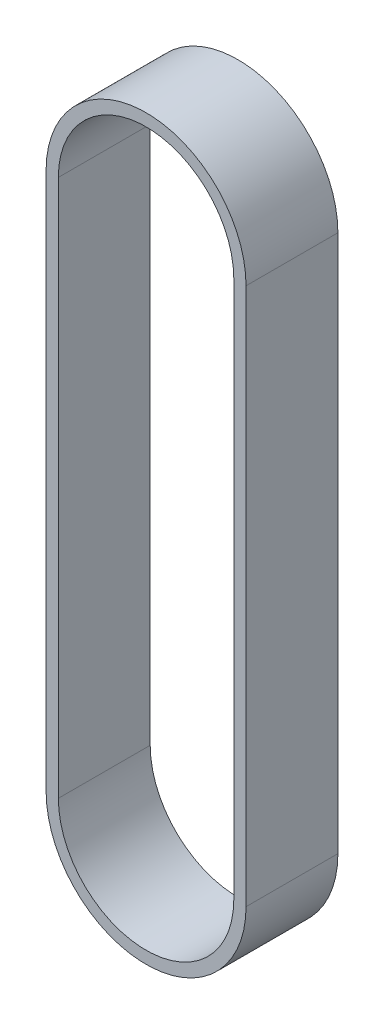
ISO-10303-21;
HEADER;
FILE_DESCRIPTION(('STEP AP214'),'2;1');
FILE_NAME('part.step','',(''),(''),'','','');
FILE_SCHEMA(('AUTOMOTIVE_DESIGN { 1 0 10303 214 1 1 1 1 }'));
ENDSEC;
DATA;
#1=APPLICATION_CONTEXT('core data for automotive mechanical design processes');
#2=APPLICATION_PROTOCOL_DEFINITION('international standard','automotive_design',2000,#1);
#3=PRODUCT_CONTEXT('',#1,'mechanical');
#4=PRODUCT('Part','Part','',(#3));
#5=PRODUCT_RELATED_PRODUCT_CATEGORY('part','',(#4));
#6=PRODUCT_DEFINITION_FORMATION('','',#4);
#7=PRODUCT_DEFINITION_CONTEXT('part definition',#1,'design');
#8=PRODUCT_DEFINITION('design','',#6,#7);
#9=PRODUCT_DEFINITION_SHAPE('','',#8);
#10=(LENGTH_UNIT() NAMED_UNIT(*) SI_UNIT(.MILLI.,.METRE.));
#11=(NAMED_UNIT(*) PLANE_ANGLE_UNIT() SI_UNIT($,.RADIAN.));
#12=(NAMED_UNIT(*) SI_UNIT($,.STERADIAN.) SOLID_ANGLE_UNIT());
#13=UNCERTAINTY_MEASURE_WITH_UNIT(LENGTH_MEASURE(1.E-05),#10,'distance_accuracy_value','');
#14=(GEOMETRIC_REPRESENTATION_CONTEXT(3) GLOBAL_UNCERTAINTY_ASSIGNED_CONTEXT((#13)) GLOBAL_UNIT_ASSIGNED_CONTEXT((#10,
#11,#12)) REPRESENTATION_CONTEXT('',''));
#15=CARTESIAN_POINT('',(0.,0.,0.));
#16=DIRECTION('',(0.,0.,1.));
#17=DIRECTION('',(1.,0.,0.));
#18=AXIS2_PLACEMENT_3D('',#15,#16,#17);
#19=CARTESIAN_POINT('',(0.,0.,7.5));
#20=DIRECTION('',(0.,0.,1.));
#21=DIRECTION('',(1.,0.,0.));
#22=AXIS2_PLACEMENT_3D('',#19,#20,#21);
#23=PLANE('',#22);
#24=CARTESIAN_POINT('',(0.,0.,7.5));
#25=DIRECTION('',(0.,0.,1.));
#26=DIRECTION('',(1.,0.,0.));
#27=AXIS2_PLACEMENT_3D('',#24,#25,#26);
#28=CIRCLE('',#27,16.325);
#29=CARTESIAN_POINT('',(16.325,0.,7.5));
#30=VERTEX_POINT('',#29);
#31=CARTESIAN_POINT('',(-16.325,0.,7.5));
#32=VERTEX_POINT('',#31);
#33=EDGE_CURVE('E159',#30,#32,#28,.T.);
#34=ORIENTED_EDGE('',*,*,#33,.T.);
#35=DIRECTION('',(0.,-1.,0.));
#36=VECTOR('',#35,1.);
#37=CARTESIAN_POINT('',(-16.325,0.,7.5));
#38=LINE('',#37,#36);
#39=CARTESIAN_POINT('',(-16.325,-87.8,7.5));
#40=VERTEX_POINT('',#39);
#41=EDGE_CURVE('E162',#32,#40,#38,.T.);
#42=ORIENTED_EDGE('',*,*,#41,.T.);
#43=CARTESIAN_POINT('',(0.,-87.8,7.5));
#44=DIRECTION('',(0.,0.,1.));
#45=DIRECTION('',(1.,0.,0.));
#46=AXIS2_PLACEMENT_3D('',#43,#44,#45);
#47=CIRCLE('',#46,16.325);
#48=CARTESIAN_POINT('',(16.325,-87.8,7.5));
#49=VERTEX_POINT('',#48);
#50=EDGE_CURVE('E165',#40,#49,#47,.T.);
#51=ORIENTED_EDGE('',*,*,#50,.T.);
#52=DIRECTION('',(0.,1.,0.));
#53=VECTOR('',#52,1.);
#54=CARTESIAN_POINT('',(16.325,0.,7.5));
#55=LINE('',#54,#53);
#56=EDGE_CURVE('E167',#49,#30,#55,.T.);
#57=ORIENTED_EDGE('',*,*,#56,.T.);
#58=EDGE_LOOP('',(#34,#42,#51,#57));
#59=FACE_BOUND('',#58,.T.);
#60=DIRECTION('',(0.,-1.,0.));
#61=VECTOR('',#60,1.);
#62=CARTESIAN_POINT('',(-14.325,0.,7.5));
#63=LINE('',#62,#61);
#64=CARTESIAN_POINT('',(-14.325,0.,7.5));
#65=VERTEX_POINT('',#64);
#66=CARTESIAN_POINT('',(-14.325,-87.8,7.5));
#67=VERTEX_POINT('',#66);
#68=EDGE_CURVE('E131',#65,#67,#63,.T.);
#69=ORIENTED_EDGE('',*,*,#68,.F.);
#70=CARTESIAN_POINT('',(0.,0.,7.5));
#71=DIRECTION('',(0.,0.,1.));
#72=DIRECTION('',(1.,0.,0.));
#73=AXIS2_PLACEMENT_3D('',#70,#71,#72);
#74=CIRCLE('',#73,14.325);
#75=CARTESIAN_POINT('',(14.325,0.,7.5));
#76=VERTEX_POINT('',#75);
#77=EDGE_CURVE('E123',#76,#65,#74,.T.);
#78=ORIENTED_EDGE('',*,*,#77,.F.);
#79=DIRECTION('',(0.,1.,0.));
#80=VECTOR('',#79,1.);
#81=CARTESIAN_POINT('',(14.325,0.,7.5));
#82=LINE('',#81,#80);
#83=CARTESIAN_POINT('',(14.325,-87.8,7.5));
#84=VERTEX_POINT('',#83);
#85=EDGE_CURVE('E145',#84,#76,#82,.T.);
#86=ORIENTED_EDGE('',*,*,#85,.F.);
#87=CARTESIAN_POINT('',(0.,-87.8,7.5));
#88=DIRECTION('',(0.,0.,1.));
#89=DIRECTION('',(1.,0.,0.));
#90=AXIS2_PLACEMENT_3D('',#87,#88,#89);
#91=CIRCLE('',#90,14.325);
#92=EDGE_CURVE('E143',#67,#84,#91,.T.);
#93=ORIENTED_EDGE('',*,*,#92,.F.);
#94=EDGE_LOOP('',(#69,#78,#86,#93));
#95=FACE_BOUND('',#94,.T.);
#96=ADVANCED_FACE('F58',(#59,#95),#23,.T.);
#97=CARTESIAN_POINT('',(0.,0.,-7.5));
#98=DIRECTION('',(0.,0.,1.));
#99=DIRECTION('',(1.,0.,0.));
#100=AXIS2_PLACEMENT_3D('',#97,#98,#99);
#101=PLANE('',#100);
#102=CARTESIAN_POINT('',(0.,0.,-7.5));
#103=DIRECTION('',(0.,0.,1.));
#104=DIRECTION('',(1.,0.,0.));
#105=AXIS2_PLACEMENT_3D('',#102,#103,#104);
#106=CIRCLE('',#105,16.325);
#107=CARTESIAN_POINT('',(16.325,0.,-7.5));
#108=VERTEX_POINT('',#107);
#109=CARTESIAN_POINT('',(-16.325,0.,-7.5));
#110=VERTEX_POINT('',#109);
#111=EDGE_CURVE('E139',#108,#110,#106,.T.);
#112=ORIENTED_EDGE('',*,*,#111,.F.);
#113=DIRECTION('',(0.,1.,0.));
#114=VECTOR('',#113,1.);
#115=CARTESIAN_POINT('',(16.325,0.,-7.5));
#116=LINE('',#115,#114);
#117=CARTESIAN_POINT('',(16.325,-87.8,-7.5));
#118=VERTEX_POINT('',#117);
#119=EDGE_CURVE('E163',#118,#108,#116,.T.);
#120=ORIENTED_EDGE('',*,*,#119,.F.);
#121=CARTESIAN_POINT('',(0.,-87.8,-7.5));
#122=DIRECTION('',(0.,0.,1.));
#123=DIRECTION('',(1.,0.,0.));
#124=AXIS2_PLACEMENT_3D('',#121,#122,#123);
#125=CIRCLE('',#124,16.325);
#126=CARTESIAN_POINT('',(-16.325,-87.8,-7.5));
#127=VERTEX_POINT('',#126);
#128=EDGE_CURVE('E174',#127,#118,#125,.T.);
#129=ORIENTED_EDGE('',*,*,#128,.F.);
#130=DIRECTION('',(0.,-1.,0.));
#131=VECTOR('',#130,1.);
#132=CARTESIAN_POINT('',(-16.325,0.,-7.5));
#133=LINE('',#132,#131);
#134=EDGE_CURVE('E172',#110,#127,#133,.T.);
#135=ORIENTED_EDGE('',*,*,#134,.F.);
#136=EDGE_LOOP('',(#112,#120,#129,#135));
#137=FACE_BOUND('',#136,.T.);
#138=CARTESIAN_POINT('',(0.,0.,-7.5));
#139=DIRECTION('',(0.,0.,1.));
#140=DIRECTION('',(1.,0.,0.));
#141=AXIS2_PLACEMENT_3D('',#138,#139,#140);
#142=CIRCLE('',#141,14.325);
#143=CARTESIAN_POINT('',(14.325,0.,-7.5));
#144=VERTEX_POINT('',#143);
#145=CARTESIAN_POINT('',(-14.325,0.,-7.5));
#146=VERTEX_POINT('',#145);
#147=EDGE_CURVE('E81',#144,#146,#142,.T.);
#148=ORIENTED_EDGE('',*,*,#147,.T.);
#149=DIRECTION('',(0.,-1.,0.));
#150=VECTOR('',#149,1.);
#151=CARTESIAN_POINT('',(-14.325,0.,-7.5));
#152=LINE('',#151,#150);
#153=CARTESIAN_POINT('',(-14.325,-87.8,-7.5));
#154=VERTEX_POINT('',#153);
#155=EDGE_CURVE('E138',#146,#154,#152,.T.);
#156=ORIENTED_EDGE('',*,*,#155,.T.);
#157=CARTESIAN_POINT('',(0.,-87.8,-7.5));
#158=DIRECTION('',(0.,0.,1.));
#159=DIRECTION('',(1.,0.,0.));
#160=AXIS2_PLACEMENT_3D('',#157,#158,#159);
#161=CIRCLE('',#160,14.325);
#162=CARTESIAN_POINT('',(14.325,-87.8,-7.5));
#163=VERTEX_POINT('',#162);
#164=EDGE_CURVE('E151',#154,#163,#161,.T.);
#165=ORIENTED_EDGE('',*,*,#164,.T.);
#166=DIRECTION('',(0.,1.,0.));
#167=VECTOR('',#166,1.);
#168=CARTESIAN_POINT('',(14.325,0.,-7.5));
#169=LINE('',#168,#167);
#170=EDGE_CURVE('E132',#163,#144,#169,.T.);
#171=ORIENTED_EDGE('',*,*,#170,.T.);
#172=EDGE_LOOP('',(#148,#156,#165,#171));
#173=FACE_BOUND('',#172,.T.);
#174=ADVANCED_FACE('F192',(#137,#173),#101,.F.);
#175=CARTESIAN_POINT('',(0.,0.,7.5));
#176=DIRECTION('',(0.,0.,-1.));
#177=DIRECTION('',(-1.,0.,0.));
#178=AXIS2_PLACEMENT_3D('',#175,#176,#177);
#179=CYLINDRICAL_SURFACE('',#178,16.325);
#180=ORIENTED_EDGE('',*,*,#111,.T.);
#181=DIRECTION('',(0.,0.,-1.));
#182=VECTOR('',#181,1.);
#183=CARTESIAN_POINT('',(-16.325,0.,7.5));
#184=LINE('',#183,#182);
#185=EDGE_CURVE('E12',#32,#110,#184,.T.);
#186=ORIENTED_EDGE('',*,*,#185,.F.);
#187=ORIENTED_EDGE('',*,*,#33,.F.);
#188=DIRECTION('',(0.,0.,-1.));
#189=VECTOR('',#188,1.);
#190=CARTESIAN_POINT('',(16.325,0.,7.5));
#191=LINE('',#190,#189);
#192=EDGE_CURVE('E169',#30,#108,#191,.T.);
#193=ORIENTED_EDGE('',*,*,#192,.T.);
#194=EDGE_LOOP('',(#180,#186,#187,#193));
#195=FACE_BOUND('',#194,.T.);
#196=ADVANCED_FACE('F60',(#195),#179,.T.);
#197=CARTESIAN_POINT('',(-16.325,0.,7.5));
#198=DIRECTION('',(1.,0.,0.));
#199=DIRECTION('',(0.,1.,0.));
#200=AXIS2_PLACEMENT_3D('',#197,#198,#199);
#201=PLANE('',#200);
#202=ORIENTED_EDGE('',*,*,#134,.T.);
#203=DIRECTION('',(0.,0.,-1.));
#204=VECTOR('',#203,1.);
#205=CARTESIAN_POINT('',(-16.325,-87.8,7.5));
#206=LINE('',#205,#204);
#207=EDGE_CURVE('E66',#40,#127,#206,.T.);
#208=ORIENTED_EDGE('',*,*,#207,.F.);
#209=ORIENTED_EDGE('',*,*,#41,.F.);
#210=ORIENTED_EDGE('',*,*,#185,.T.);
#211=EDGE_LOOP('',(#202,#208,#209,#210));
#212=FACE_BOUND('',#211,.T.);
#213=ADVANCED_FACE('F202',(#212),#201,.F.);
#214=CARTESIAN_POINT('',(0.,-87.8,7.5));
#215=DIRECTION('',(0.,0.,-1.));
#216=DIRECTION('',(-1.,0.,0.));
#217=AXIS2_PLACEMENT_3D('',#214,#215,#216);
#218=CYLINDRICAL_SURFACE('',#217,16.325);
#219=ORIENTED_EDGE('',*,*,#128,.T.);
#220=DIRECTION('',(0.,0.,-1.));
#221=VECTOR('',#220,1.);
#222=CARTESIAN_POINT('',(16.325,-87.8,7.5));
#223=LINE('',#222,#221);
#224=EDGE_CURVE('E179',#49,#118,#223,.T.);
#225=ORIENTED_EDGE('',*,*,#224,.F.);
#226=ORIENTED_EDGE('',*,*,#50,.F.);
#227=ORIENTED_EDGE('',*,*,#207,.T.);
#228=EDGE_LOOP('',(#219,#225,#226,#227));
#229=FACE_BOUND('',#228,.T.);
#230=ADVANCED_FACE('F186',(#229),#218,.T.);
#231=CARTESIAN_POINT('',(16.325,0.,7.5));
#232=DIRECTION('',(-1.,0.,0.));
#233=DIRECTION('',(0.,-1.,0.));
#234=AXIS2_PLACEMENT_3D('',#231,#232,#233);
#235=PLANE('',#234);
#236=ORIENTED_EDGE('',*,*,#119,.T.);
#237=ORIENTED_EDGE('',*,*,#192,.F.);
#238=ORIENTED_EDGE('',*,*,#56,.F.);
#239=ORIENTED_EDGE('',*,*,#224,.T.);
#240=EDGE_LOOP('',(#236,#237,#238,#239));
#241=FACE_BOUND('',#240,.T.);
#242=ADVANCED_FACE('F196',(#241),#235,.F.);
#243=CARTESIAN_POINT('',(0.,0.,7.5));
#244=DIRECTION('',(0.,0.,-1.));
#245=DIRECTION('',(-1.,0.,0.));
#246=AXIS2_PLACEMENT_3D('',#243,#244,#245);
#247=CYLINDRICAL_SURFACE('',#246,14.325);
#248=ORIENTED_EDGE('',*,*,#147,.F.);
#249=DIRECTION('',(0.,0.,-1.));
#250=VECTOR('',#249,1.);
#251=CARTESIAN_POINT('',(14.325,0.,7.5));
#252=LINE('',#251,#250);
#253=EDGE_CURVE('E127',#76,#144,#252,.T.);
#254=ORIENTED_EDGE('',*,*,#253,.F.);
#255=ORIENTED_EDGE('',*,*,#77,.T.);
#256=DIRECTION('',(0.,0.,-1.));
#257=VECTOR('',#256,1.);
#258=CARTESIAN_POINT('',(-14.325,0.,7.5));
#259=LINE('',#258,#257);
#260=EDGE_CURVE('E126',#65,#146,#259,.T.);
#261=ORIENTED_EDGE('',*,*,#260,.T.);
#262=EDGE_LOOP('',(#248,#254,#255,#261));
#263=FACE_BOUND('',#262,.T.);
#264=ADVANCED_FACE('F125',(#263),#247,.F.);
#265=CARTESIAN_POINT('',(-14.325,0.,7.5));
#266=DIRECTION('',(1.,0.,0.));
#267=DIRECTION('',(0.,1.,0.));
#268=AXIS2_PLACEMENT_3D('',#265,#266,#267);
#269=PLANE('',#268);
#270=ORIENTED_EDGE('',*,*,#155,.F.);
#271=ORIENTED_EDGE('',*,*,#260,.F.);
#272=ORIENTED_EDGE('',*,*,#68,.T.);
#273=DIRECTION('',(0.,0.,-1.));
#274=VECTOR('',#273,1.);
#275=CARTESIAN_POINT('',(-14.325,-87.8,7.5));
#276=LINE('',#275,#274);
#277=EDGE_CURVE('E140',#67,#154,#276,.T.);
#278=ORIENTED_EDGE('',*,*,#277,.T.);
#279=EDGE_LOOP('',(#270,#271,#272,#278));
#280=FACE_BOUND('',#279,.T.);
#281=ADVANCED_FACE('F135',(#280),#269,.T.);
#282=CARTESIAN_POINT('',(0.,-87.8,7.5));
#283=DIRECTION('',(0.,0.,-1.));
#284=DIRECTION('',(-1.,0.,0.));
#285=AXIS2_PLACEMENT_3D('',#282,#283,#284);
#286=CYLINDRICAL_SURFACE('',#285,14.325);
#287=ORIENTED_EDGE('',*,*,#164,.F.);
#288=ORIENTED_EDGE('',*,*,#277,.F.);
#289=ORIENTED_EDGE('',*,*,#92,.T.);
#290=DIRECTION('',(0.,0.,-1.));
#291=VECTOR('',#290,1.);
#292=CARTESIAN_POINT('',(14.325,-87.8,7.5));
#293=LINE('',#292,#291);
#294=EDGE_CURVE('E73',#84,#163,#293,.T.);
#295=ORIENTED_EDGE('',*,*,#294,.T.);
#296=EDGE_LOOP('',(#287,#288,#289,#295));
#297=FACE_BOUND('',#296,.T.);
#298=ADVANCED_FACE('F225',(#297),#286,.F.);
#299=CARTESIAN_POINT('',(14.325,0.,7.5));
#300=DIRECTION('',(-1.,0.,0.));
#301=DIRECTION('',(0.,-1.,0.));
#302=AXIS2_PLACEMENT_3D('',#299,#300,#301);
#303=PLANE('',#302);
#304=ORIENTED_EDGE('',*,*,#170,.F.);
#305=ORIENTED_EDGE('',*,*,#294,.F.);
#306=ORIENTED_EDGE('',*,*,#85,.T.);
#307=ORIENTED_EDGE('',*,*,#253,.T.);
#308=EDGE_LOOP('',(#304,#305,#306,#307));
#309=FACE_BOUND('',#308,.T.);
#310=ADVANCED_FACE('F229',(#309),#303,.T.);
#311=CLOSED_SHELL('',(#96,#174,#196,#213,#230,#242,#264,#281,#298,#310));
#312=MANIFOLD_SOLID_BREP('B2',#311);
#313=ADVANCED_BREP_SHAPE_REPRESENTATION('',(#18,#312),#14);
#314=SHAPE_DEFINITION_REPRESENTATION(#9,#313);
ENDSEC;
END-ISO-10303-21;
